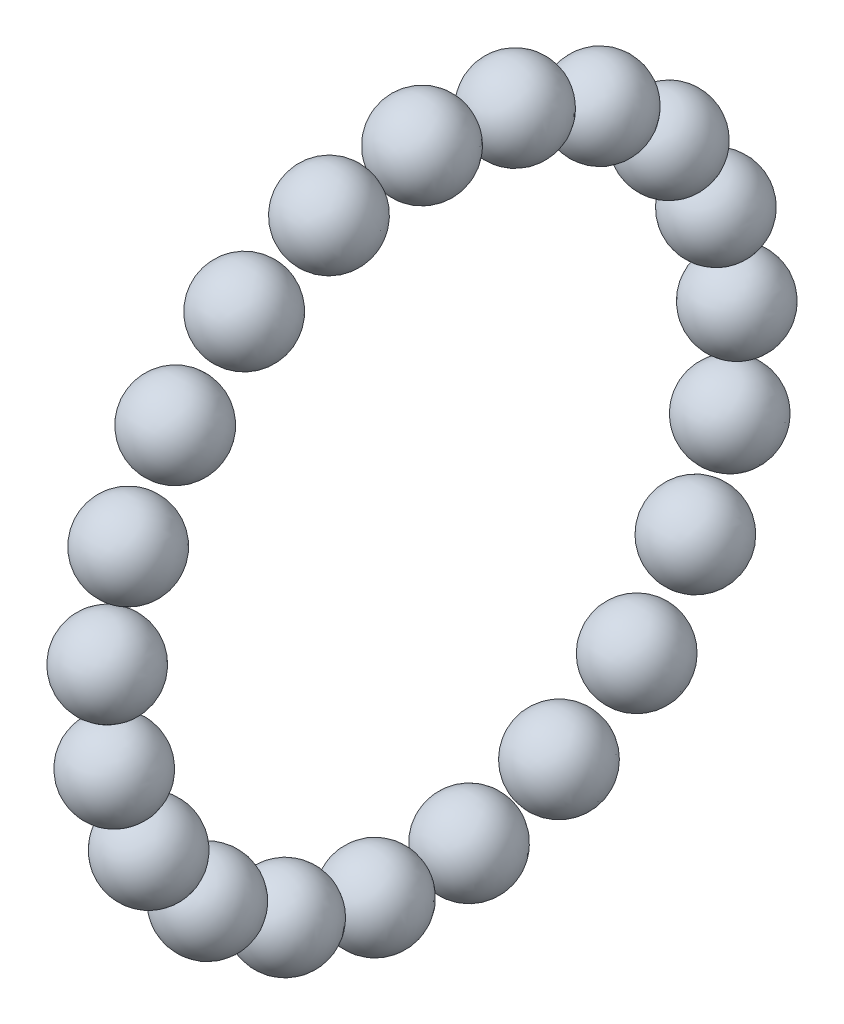
ISO-10303-21;
HEADER;
FILE_DESCRIPTION(('STEP AP214'),'2;1');
FILE_NAME('part.step','',(''),(''),'','','');
FILE_SCHEMA(('AUTOMOTIVE_DESIGN { 1 0 10303 214 1 1 1 1 }'));
ENDSEC;
DATA;
#1=APPLICATION_CONTEXT('core data for automotive mechanical design processes');
#2=APPLICATION_PROTOCOL_DEFINITION('international standard','automotive_design',2000,#1);
#3=PRODUCT_CONTEXT('',#1,'mechanical');
#4=PRODUCT('Part','Part','',(#3));
#5=PRODUCT_RELATED_PRODUCT_CATEGORY('part','',(#4));
#6=PRODUCT_DEFINITION_FORMATION('','',#4);
#7=PRODUCT_DEFINITION_CONTEXT('part definition',#1,'design');
#8=PRODUCT_DEFINITION('design','',#6,#7);
#9=PRODUCT_DEFINITION_SHAPE('','',#8);
#10=(LENGTH_UNIT() NAMED_UNIT(*) SI_UNIT(.MILLI.,.METRE.));
#11=(NAMED_UNIT(*) PLANE_ANGLE_UNIT() SI_UNIT($,.RADIAN.));
#12=(NAMED_UNIT(*) SI_UNIT($,.STERADIAN.) SOLID_ANGLE_UNIT());
#13=UNCERTAINTY_MEASURE_WITH_UNIT(LENGTH_MEASURE(1.E-05),#10,'distance_accuracy_value','');
#14=(GEOMETRIC_REPRESENTATION_CONTEXT(3) GLOBAL_UNCERTAINTY_ASSIGNED_CONTEXT((#13)) GLOBAL_UNIT_ASSIGNED_CONTEXT((#10,
#11,#12)) REPRESENTATION_CONTEXT('',''));
#15=CARTESIAN_POINT('',(0.,0.,0.));
#16=DIRECTION('',(0.,0.,1.));
#17=DIRECTION('',(1.,0.,0.));
#18=AXIS2_PLACEMENT_3D('',#15,#16,#17);
#19=CARTESIAN_POINT('',(0.,12.8067010018979,-8.73146089998614));
#20=DIRECTION('',(0.,0.563320058063622,0.826238774315995));
#21=DIRECTION('',(1.,0.,0.));
#22=AXIS2_PLACEMENT_3D('',#19,#20,#21);
#23=SPHERICAL_SURFACE('',#22,2.1);
#24=CARTESIAN_POINT('',(0.,13.9896731238315,-6.99635947392255));
#25=VERTEX_POINT('',#24);
#26=VERTEX_LOOP('',#25);
#27=FACE_BOUND('',#26,.T.);
#28=ADVANCED_FACE('F12',(#27),#23,.T.);
#29=CLOSED_SHELL('',(#28));
#30=MANIFOLD_SOLID_BREP('B1',#29);
#31=CARTESIAN_POINT('',(0.,5.66278587767913,-14.4285431039852));
#32=DIRECTION('',(0.,0.930873748644204,0.365341024366396));
#33=DIRECTION('',(1.,0.,0.));
#34=AXIS2_PLACEMENT_3D('',#31,#32,#33);
#35=SPHERICAL_SURFACE('',#34,2.1);
#36=CARTESIAN_POINT('',(0.,7.61762074983196,-13.6613269528157));
#37=VERTEX_POINT('',#36);
#38=VERTEX_LOOP('',#37);
#39=FACE_BOUND('',#38,.T.);
#40=ADVANCED_FACE('F20',(#39),#35,.T.);
#41=CLOSED_SHELL('',(#40));
#42=MANIFOLD_SOLID_BREP('B1',#41);
#43=CARTESIAN_POINT('',(0.,-3.44907447632288,-15.1113826388182));
#44=DIRECTION('',(0.,0.974927912181824,-0.222520933956315));
#45=DIRECTION('',(1.,0.,0.));
#46=AXIS2_PLACEMENT_3D('',#43,#44,#45);
#47=SPHERICAL_SURFACE('',#46,2.1);
#48=CARTESIAN_POINT('',(0.,-1.40172586074104,-15.5786766001265));
#49=VERTEX_POINT('',#48);
#50=VERTEX_LOOP('',#49);
#51=FACE_BOUND('',#50,.T.);
#52=ADVANCED_FACE('F30',(#51),#47,.T.);
#53=CLOSED_SHELL('',(#52));
#54=MANIFOLD_SOLID_BREP('B1',#53);
#55=CARTESIAN_POINT('',(0.,-11.3623040133623,-10.5426774354492));
#56=DIRECTION('',(0.,0.68017273777092,-0.733051871829826));
#57=DIRECTION('',(1.,0.,0.));
#58=AXIS2_PLACEMENT_3D('',#55,#56,#57);
#59=SPHERICAL_SURFACE('',#58,2.1);
#60=CARTESIAN_POINT('',(0.,-9.93394126404337,-12.0820863662919));
#61=VERTEX_POINT('',#60);
#62=VERTEX_LOOP('',#61);
#63=FACE_BOUND('',#62,.T.);
#64=ADVANCED_FACE('F34',(#63),#59,.T.);
#65=CLOSED_SHELL('',(#64));
#66=MANIFOLD_SOLID_BREP('B1',#65);
#67=CARTESIAN_POINT('',(0.,-15.3268778064895,-2.3101551257307));
#68=DIRECTION('',(0.,0.149042266176174,-0.988830826225129));
#69=DIRECTION('',(1.,0.,0.));
#70=AXIS2_PLACEMENT_3D('',#67,#68,#69);
#71=SPHERICAL_SURFACE('',#70,2.1);
#72=CARTESIAN_POINT('',(0.,-15.0138890475195,-4.38669986080348));
#73=VERTEX_POINT('',#72);
#74=VERTEX_LOOP('',#73);
#75=FACE_BOUND('',#74,.T.);
#76=ADVANCED_FACE('F39',(#75),#71,.T.);
#77=CLOSED_SHELL('',(#76));
#78=MANIFOLD_SOLID_BREP('B1',#77);
#79=CARTESIAN_POINT('',(0.,-13.9650174524875,6.72519795632215));
#80=DIRECTION('',(0.,-0.433883739117559,-0.900968867902419));
#81=DIRECTION('',(1.,0.,0.));
#82=AXIS2_PLACEMENT_3D('',#79,#80,#81);
#83=SPHERICAL_SURFACE('',#82,2.1);
#84=CARTESIAN_POINT('',(0.,-14.8761733046344,4.83316333372707));
#85=VERTEX_POINT('',#84);
#86=VERTEX_LOOP('',#85);
#87=FACE_BOUND('',#86,.T.);
#88=ADVANCED_FACE('F44',(#87),#83,.T.);
#89=CLOSED_SHELL('',(#88));
#90=MANIFOLD_SOLID_BREP('B1',#89);
#91=CARTESIAN_POINT('',(0.,-7.75,13.4233937586588));
#92=DIRECTION('',(0.,-0.866025403784439,-0.5));
#93=DIRECTION('',(1.,0.,0.));
#94=AXIS2_PLACEMENT_3D('',#91,#92,#93);
#95=SPHERICAL_SURFACE('',#94,2.1);
#96=CARTESIAN_POINT('',(0.,-9.56865334794732,12.3733937586588));
#97=VERTEX_POINT('',#96);
#98=VERTEX_LOOP('',#97);
#99=FACE_BOUND('',#98,.T.);
#100=ADVANCED_FACE('F49',(#99),#95,.T.);
#101=CLOSED_SHELL('',(#100));
#102=MANIFOLD_SOLID_BREP('B1',#101);
#103=CARTESIAN_POINT('',(0.,1.15831645058957,15.4566588563083));
#104=DIRECTION('',(0.,-0.99720379718118,0.0747300935864242));
#105=DIRECTION('',(1.,0.,0.));
#106=AXIS2_PLACEMENT_3D('',#103,#104,#105);
#107=SPHERICAL_SURFACE('',#106,2.1);
#108=CARTESIAN_POINT('',(0.,-0.935811523490904,15.6135920528398));
#109=VERTEX_POINT('',#108);
#110=VERTEX_LOOP('',#109);
#111=FACE_BOUND('',#110,.T.);
#112=ADVANCED_FACE('F54',(#111),#107,.T.);
#113=CLOSED_SHELL('',(#112));
#114=MANIFOLD_SOLID_BREP('B1',#113);
#115=CARTESIAN_POINT('',(0.,9.66409192881037,12.1183879782545));
#116=DIRECTION('',(0.,-0.78183148246803,0.623489801858734));
#117=DIRECTION('',(1.,0.,0.));
#118=AXIS2_PLACEMENT_3D('',#115,#116,#117);
#119=SPHERICAL_SURFACE('',#118,2.1);
#120=CARTESIAN_POINT('',(0.,8.02224581562751,13.4277165621578));
#121=VERTEX_POINT('',#120);
#122=VERTEX_LOOP('',#121);
#123=FACE_BOUND('',#122,.T.);
#124=ADVANCED_FACE('F59',(#123),#119,.T.);
#125=CLOSED_SHELL('',(#124));
#126=MANIFOLD_SOLID_BREP('B1',#125);
#127=CARTESIAN_POINT('',(0.,14.8113784896852,4.56870520336901));
#128=DIRECTION('',(0.,-0.294755174410904,0.955572805786141));
#129=DIRECTION('',(1.,0.,0.));
#130=AXIS2_PLACEMENT_3D('',#127,#128,#129);
#131=SPHERICAL_SURFACE('',#130,2.1);
#132=CARTESIAN_POINT('',(0.,14.1923926234223,6.57540809551991));
#133=VERTEX_POINT('',#132);
#134=VERTEX_LOOP('',#133);
#135=FACE_BOUND('',#134,.T.);
#136=ADVANCED_FACE('F64',(#135),#131,.T.);
#137=CLOSED_SHELL('',(#136));
#138=MANIFOLD_SOLID_BREP('B1',#137);
#139=CARTESIAN_POINT('',(0.,0.,0.));
#140=DIRECTION('',(0.,0.,1.));
#141=DIRECTION('',(1.,0.,0.));
#142=AXIS2_PLACEMENT_3D('',#139,#140,#141);
#143=SPHERICAL_SURFACE('',#142,0.005);
#144=CARTESIAN_POINT('',(0.,0.,0.005));
#145=VERTEX_POINT('',#144);
#146=VERTEX_LOOP('',#145);
#147=FACE_BOUND('',#146,.T.);
#148=ADVANCED_FACE('F69',(#147),#143,.T.);
#149=CLOSED_SHELL('',(#148));
#150=MANIFOLD_SOLID_BREP('B1',#149);
#151=CARTESIAN_POINT('',(0.,15.5,0.));
#152=DIRECTION('',(0.,0.,1.));
#153=DIRECTION('',(1.,0.,0.));
#154=AXIS2_PLACEMENT_3D('',#151,#152,#153);
#155=SPHERICAL_SURFACE('',#154,2.1);
#156=CARTESIAN_POINT('',(0.,15.5,2.1));
#157=VERTEX_POINT('',#156);
#158=VERTEX_LOOP('',#157);
#159=FACE_BOUND('',#158,.T.);
#160=ADVANCED_FACE('F74',(#159),#155,.T.);
#161=CLOSED_SHELL('',(#160));
#162=MANIFOLD_SOLID_BREP('B1',#161);
#163=CARTESIAN_POINT('',(0.,12.8067010018979,8.73146089998614));
#164=DIRECTION('',(0.,-0.563320058063622,0.826238774315995));
#165=DIRECTION('',(1.,0.,0.));
#166=AXIS2_PLACEMENT_3D('',#163,#164,#165);
#167=SPHERICAL_SURFACE('',#166,2.1);
#168=CARTESIAN_POINT('',(0.,11.6237288799643,10.4665623260497));
#169=VERTEX_POINT('',#168);
#170=VERTEX_LOOP('',#169);
#171=FACE_BOUND('',#170,.T.);
#172=ADVANCED_FACE('F79',(#171),#167,.T.);
#173=CLOSED_SHELL('',(#172));
#174=MANIFOLD_SOLID_BREP('B1',#173);
#175=CARTESIAN_POINT('',(0.,5.66278587767912,14.4285431039852));
#176=DIRECTION('',(0.,-0.930873748644204,0.365341024366395));
#177=DIRECTION('',(1.,0.,0.));
#178=AXIS2_PLACEMENT_3D('',#175,#176,#177);
#179=SPHERICAL_SURFACE('',#178,2.1);
#180=CARTESIAN_POINT('',(0.,3.70795100552629,15.1957592551546));
#181=VERTEX_POINT('',#180);
#182=VERTEX_LOOP('',#181);
#183=FACE_BOUND('',#182,.T.);
#184=ADVANCED_FACE('F84',(#183),#179,.T.);
#185=CLOSED_SHELL('',(#184));
#186=MANIFOLD_SOLID_BREP('B1',#185);
#187=CARTESIAN_POINT('',(0.,-3.44907447632287,15.1113826388182));
#188=DIRECTION('',(0.,-0.974927912181824,-0.222520933956315));
#189=DIRECTION('',(1.,0.,0.));
#190=AXIS2_PLACEMENT_3D('',#187,#188,#189);
#191=SPHERICAL_SURFACE('',#190,2.1);
#192=CARTESIAN_POINT('',(0.,-5.4964230919047,14.64408867751));
#193=VERTEX_POINT('',#192);
#194=VERTEX_LOOP('',#193);
#195=FACE_BOUND('',#194,.T.);
#196=ADVANCED_FACE('F89',(#195),#191,.T.);
#197=CLOSED_SHELL('',(#196));
#198=MANIFOLD_SOLID_BREP('B1',#197);
#199=CARTESIAN_POINT('',(0.,-11.3623040133623,10.5426774354492));
#200=DIRECTION('',(0.,-0.680172737770919,-0.733051871829826));
#201=DIRECTION('',(1.,0.,0.));
#202=AXIS2_PLACEMENT_3D('',#199,#200,#201);
#203=SPHERICAL_SURFACE('',#202,2.1);
#204=CARTESIAN_POINT('',(0.,-12.7906667626812,9.00326850460661));
#205=VERTEX_POINT('',#204);
#206=VERTEX_LOOP('',#205);
#207=FACE_BOUND('',#206,.T.);
#208=ADVANCED_FACE('F94',(#207),#203,.T.);
#209=CLOSED_SHELL('',(#208));
#210=MANIFOLD_SOLID_BREP('B1',#209);
#211=CARTESIAN_POINT('',(0.,-15.3268778064895,2.3101551257307));
#212=DIRECTION('',(0.,-0.149042266176174,-0.988830826225129));
#213=DIRECTION('',(1.,0.,0.));
#214=AXIS2_PLACEMENT_3D('',#211,#212,#213);
#215=SPHERICAL_SURFACE('',#214,2.1);
#216=CARTESIAN_POINT('',(0.,-15.6398665654595,0.233610390657929));
#217=VERTEX_POINT('',#216);
#218=VERTEX_LOOP('',#217);
#219=FACE_BOUND('',#218,.T.);
#220=ADVANCED_FACE('F99',(#219),#215,.T.);
#221=CLOSED_SHELL('',(#220));
#222=MANIFOLD_SOLID_BREP('B1',#221);
#223=CARTESIAN_POINT('',(0.,-13.9650174524875,-6.72519795632215));
#224=DIRECTION('',(0.,0.433883739117558,-0.900968867902419));
#225=DIRECTION('',(1.,0.,0.));
#226=AXIS2_PLACEMENT_3D('',#223,#224,#225);
#227=SPHERICAL_SURFACE('',#226,2.1);
#228=CARTESIAN_POINT('',(0.,-13.0538616003406,-8.61723257891723));
#229=VERTEX_POINT('',#228);
#230=VERTEX_LOOP('',#229);
#231=FACE_BOUND('',#230,.T.);
#232=ADVANCED_FACE('F104',(#231),#227,.T.);
#233=CLOSED_SHELL('',(#232));
#234=MANIFOLD_SOLID_BREP('B1',#233);
#235=CARTESIAN_POINT('',(0.,-7.75,-13.4233937586588));
#236=DIRECTION('',(0.,0.866025403784439,-0.5));
#237=DIRECTION('',(1.,0.,0.));
#238=AXIS2_PLACEMENT_3D('',#235,#236,#237);
#239=SPHERICAL_SURFACE('',#238,2.1);
#240=CARTESIAN_POINT('',(0.,-5.93134665205268,-14.4733937586588));
#241=VERTEX_POINT('',#240);
#242=VERTEX_LOOP('',#241);
#243=FACE_BOUND('',#242,.T.);
#244=ADVANCED_FACE('F109',(#243),#239,.T.);
#245=CLOSED_SHELL('',(#244));
#246=MANIFOLD_SOLID_BREP('B1',#245);
#247=CARTESIAN_POINT('',(0.,1.15831645058958,-15.4566588563083));
#248=DIRECTION('',(0.,0.99720379718118,0.0747300935864244));
#249=DIRECTION('',(1.,0.,0.));
#250=AXIS2_PLACEMENT_3D('',#247,#248,#249);
#251=SPHERICAL_SURFACE('',#250,2.1);
#252=CARTESIAN_POINT('',(0.,3.25244442467005,-15.2997256597768));
#253=VERTEX_POINT('',#252);
#254=VERTEX_LOOP('',#253);
#255=FACE_BOUND('',#254,.T.);
#256=ADVANCED_FACE('F114',(#255),#251,.T.);
#257=CLOSED_SHELL('',(#256));
#258=MANIFOLD_SOLID_BREP('B1',#257);
#259=CARTESIAN_POINT('',(0.,9.66409192881037,-12.1183879782545));
#260=DIRECTION('',(0.,0.78183148246803,0.623489801858734));
#261=DIRECTION('',(1.,0.,0.));
#262=AXIS2_PLACEMENT_3D('',#259,#260,#261);
#263=SPHERICAL_SURFACE('',#262,2.1);
#264=CARTESIAN_POINT('',(0.,11.3059380419932,-10.8090593943511));
#265=VERTEX_POINT('',#264);
#266=VERTEX_LOOP('',#265);
#267=FACE_BOUND('',#266,.T.);
#268=ADVANCED_FACE('F118',(#267),#263,.T.);
#269=CLOSED_SHELL('',(#268));
#270=MANIFOLD_SOLID_BREP('B1',#269);
#271=CARTESIAN_POINT('',(0.,14.8113784896852,-4.56870520336901));
#272=DIRECTION('',(0.,0.294755174410904,0.955572805786141));
#273=DIRECTION('',(1.,0.,0.));
#274=AXIS2_PLACEMENT_3D('',#271,#272,#273);
#275=SPHERICAL_SURFACE('',#274,2.1);
#276=CARTESIAN_POINT('',(0.,15.4303643559481,-2.56200231121811));
#277=VERTEX_POINT('',#276);
#278=VERTEX_LOOP('',#277);
#279=FACE_BOUND('',#278,.T.);
#280=ADVANCED_FACE('F14',(#279),#275,.T.);
#281=CLOSED_SHELL('',(#280));
#282=MANIFOLD_SOLID_BREP('B1',#281);
#283=ADVANCED_BREP_SHAPE_REPRESENTATION('',(#18,#30,#42,#54,#66,#78,#90,#102,#114,#126,#138,
#150,#162,#174,#186,#198,#210,#222,#234,#246,#258,#270,#282),#14);
#284=SHAPE_DEFINITION_REPRESENTATION(#9,#283);
ENDSEC;
END-ISO-10303-21;
